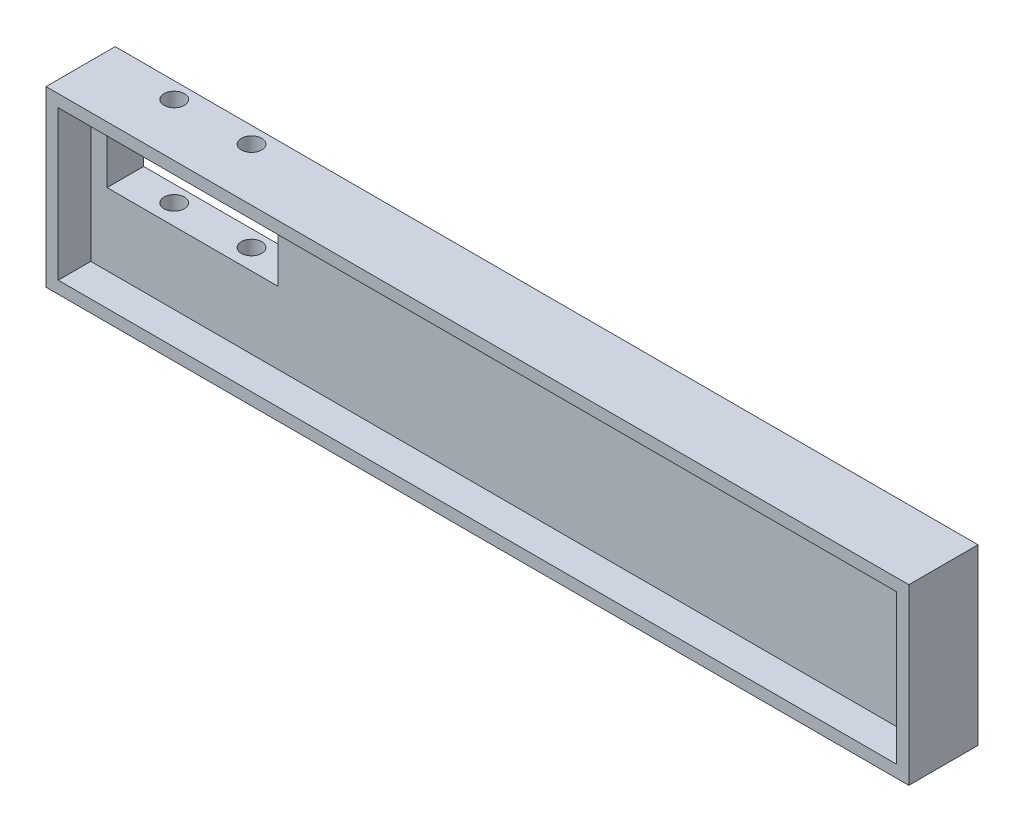
ISO-10303-21;
HEADER;
FILE_DESCRIPTION(('STEP AP214'),'2;1');
FILE_NAME('part.step','',(''),(''),'','','');
FILE_SCHEMA(('AUTOMOTIVE_DESIGN { 1 0 10303 214 1 1 1 1 }'));
ENDSEC;
DATA;
#1=APPLICATION_CONTEXT('core data for automotive mechanical design processes');
#2=APPLICATION_PROTOCOL_DEFINITION('international standard','automotive_design',2000,#1);
#3=PRODUCT_CONTEXT('',#1,'mechanical');
#4=PRODUCT('Part','Part','',(#3));
#5=PRODUCT_RELATED_PRODUCT_CATEGORY('part','',(#4));
#6=PRODUCT_DEFINITION_FORMATION('','',#4);
#7=PRODUCT_DEFINITION_CONTEXT('part definition',#1,'design');
#8=PRODUCT_DEFINITION('design','',#6,#7);
#9=PRODUCT_DEFINITION_SHAPE('','',#8);
#10=(LENGTH_UNIT() NAMED_UNIT(*) SI_UNIT(.MILLI.,.METRE.));
#11=(NAMED_UNIT(*) PLANE_ANGLE_UNIT() SI_UNIT($,.RADIAN.));
#12=(NAMED_UNIT(*) SI_UNIT($,.STERADIAN.) SOLID_ANGLE_UNIT());
#13=UNCERTAINTY_MEASURE_WITH_UNIT(LENGTH_MEASURE(1.E-05),#10,'distance_accuracy_value','');
#14=(GEOMETRIC_REPRESENTATION_CONTEXT(3) GLOBAL_UNCERTAINTY_ASSIGNED_CONTEXT((#13)) GLOBAL_UNIT_ASSIGNED_CONTEXT((#10,
#11,#12)) REPRESENTATION_CONTEXT('',''));
#15=CARTESIAN_POINT('',(0.,0.,0.));
#16=DIRECTION('',(0.,0.,1.));
#17=DIRECTION('',(1.,0.,0.));
#18=AXIS2_PLACEMENT_3D('',#15,#16,#17);
#19=CARTESIAN_POINT('',(-7.,0.,5.));
#20=DIRECTION('',(1.,0.,0.));
#21=DIRECTION('',(0.,1.,0.));
#22=AXIS2_PLACEMENT_3D('',#19,#20,#21);
#23=PLANE('',#22);
#24=DIRECTION('',(0.,0.,-1.));
#25=VECTOR('',#24,1.);
#26=CARTESIAN_POINT('',(-7.,18.3911439114408,5.));
#27=LINE('',#26,#25);
#28=CARTESIAN_POINT('',(-7.,18.3911439114408,5.));
#29=VERTEX_POINT('',#28);
#30=CARTESIAN_POINT('',(-7.,18.3911439114408,-3.5));
#31=VERTEX_POINT('',#30);
#32=EDGE_CURVE('E228',#29,#31,#27,.T.);
#33=ORIENTED_EDGE('',*,*,#32,.T.);
#34=DIRECTION('',(0.,-1.,0.));
#35=VECTOR('',#34,1.);
#36=CARTESIAN_POINT('',(-7.,0.,-3.5));
#37=LINE('',#36,#35);
#38=CARTESIAN_POINT('',(-7.,-2.95885608855919,-3.5));
#39=VERTEX_POINT('',#38);
#40=EDGE_CURVE('E181',#31,#39,#37,.T.);
#41=ORIENTED_EDGE('',*,*,#40,.T.);
#42=DIRECTION('',(0.,0.,-1.));
#43=VECTOR('',#42,1.);
#44=CARTESIAN_POINT('',(-7.,-2.95885608855919,5.));
#45=LINE('',#44,#43);
#46=CARTESIAN_POINT('',(-7.,-2.95885608855919,5.));
#47=VERTEX_POINT('',#46);
#48=EDGE_CURVE('E11',#47,#39,#45,.T.);
#49=ORIENTED_EDGE('',*,*,#48,.F.);
#50=DIRECTION('',(0.,-1.,0.));
#51=VECTOR('',#50,1.);
#52=CARTESIAN_POINT('',(-7.,0.,5.));
#53=LINE('',#52,#51);
#54=EDGE_CURVE('E218',#29,#47,#53,.T.);
#55=ORIENTED_EDGE('',*,*,#54,.F.);
#56=EDGE_LOOP('',(#33,#41,#49,#55));
#57=FACE_BOUND('',#56,.T.);
#58=ADVANCED_FACE('F35',(#57),#23,.F.);
#59=CARTESIAN_POINT('',(0.,-2.95885608855918,5.));
#60=DIRECTION('',(0.,1.,0.));
#61=DIRECTION('',(-1.,0.,0.));
#62=AXIS2_PLACEMENT_3D('',#59,#60,#61);
#63=PLANE('',#62);
#64=CARTESIAN_POINT('',(11.75,-2.95885608855918,-1.5));
#65=DIRECTION('',(0.,1.,0.));
#66=DIRECTION('',(-1.,0.,0.));
#67=AXIS2_PLACEMENT_3D('',#64,#65,#66);
#68=CIRCLE('',#67,1.25);
#69=CARTESIAN_POINT('',(10.5,-2.95885608855918,-1.5));
#70=VERTEX_POINT('',#69);
#71=EDGE_CURVE('E162',#70,#70,#68,.T.);
#72=ORIENTED_EDGE('',*,*,#71,.T.);
#73=EDGE_LOOP('',(#72));
#74=FACE_BOUND('',#73,.T.);
#75=CARTESIAN_POINT('',(2.25,-2.95885608855918,-1.5));
#76=DIRECTION('',(0.,1.,0.));
#77=DIRECTION('',(-1.,0.,0.));
#78=AXIS2_PLACEMENT_3D('',#75,#76,#77);
#79=CIRCLE('',#78,1.25);
#80=CARTESIAN_POINT('',(0.999999999999998,-2.95885608855918,-1.5));
#81=VERTEX_POINT('',#80);
#82=EDGE_CURVE('E171',#81,#81,#79,.T.);
#83=ORIENTED_EDGE('',*,*,#82,.T.);
#84=EDGE_LOOP('',(#83));
#85=FACE_BOUND('',#84,.T.);
#86=ORIENTED_EDGE('',*,*,#48,.T.);
#87=DIRECTION('',(1.,0.,0.));
#88=VECTOR('',#87,1.);
#89=CARTESIAN_POINT('',(0.,-2.95885608855918,-3.5));
#90=LINE('',#89,#88);
#91=CARTESIAN_POINT('',(99.,-2.95885608855919,-3.5));
#92=VERTEX_POINT('',#91);
#93=EDGE_CURVE('E184',#39,#92,#90,.T.);
#94=ORIENTED_EDGE('',*,*,#93,.T.);
#95=DIRECTION('',(0.,0.,-1.));
#96=VECTOR('',#95,1.);
#97=CARTESIAN_POINT('',(99.,-2.95885608855919,5.));
#98=LINE('',#97,#96);
#99=CARTESIAN_POINT('',(99.,-2.95885608855919,5.));
#100=VERTEX_POINT('',#99);
#101=EDGE_CURVE('E44',#100,#92,#98,.T.);
#102=ORIENTED_EDGE('',*,*,#101,.F.);
#103=DIRECTION('',(1.,0.,0.));
#104=VECTOR('',#103,1.);
#105=CARTESIAN_POINT('',(0.,-2.95885608855918,5.));
#106=LINE('',#105,#104);
#107=EDGE_CURVE('E221',#47,#100,#106,.T.);
#108=ORIENTED_EDGE('',*,*,#107,.F.);
#109=EDGE_LOOP('',(#86,#94,#102,#108));
#110=FACE_BOUND('',#109,.T.);
#111=ADVANCED_FACE('F277',(#74,#85,#110),#63,.F.);
#112=CARTESIAN_POINT('',(99.,0.,5.));
#113=DIRECTION('',(1.,0.,0.));
#114=DIRECTION('',(0.,0.,-1.));
#115=AXIS2_PLACEMENT_3D('',#112,#113,#114);
#116=PLANE('',#115);
#117=ORIENTED_EDGE('',*,*,#101,.T.);
#118=DIRECTION('',(0.,-1.,0.));
#119=VECTOR('',#118,1.);
#120=CARTESIAN_POINT('',(99.,0.,-3.5));
#121=LINE('',#120,#119);
#122=CARTESIAN_POINT('',(99.,18.3911439114409,-3.5));
#123=VERTEX_POINT('',#122);
#124=EDGE_CURVE('E187',#123,#92,#121,.T.);
#125=ORIENTED_EDGE('',*,*,#124,.F.);
#126=DIRECTION('',(0.,0.,-1.));
#127=VECTOR('',#126,1.);
#128=CARTESIAN_POINT('',(99.,18.3911439114409,5.));
#129=LINE('',#128,#127);
#130=CARTESIAN_POINT('',(99.,18.3911439114409,5.));
#131=VERTEX_POINT('',#130);
#132=EDGE_CURVE('E230',#131,#123,#129,.T.);
#133=ORIENTED_EDGE('',*,*,#132,.F.);
#134=DIRECTION('',(0.,-1.,0.));
#135=VECTOR('',#134,1.);
#136=CARTESIAN_POINT('',(99.,0.,5.));
#137=LINE('',#136,#135);
#138=EDGE_CURVE('E223',#131,#100,#137,.T.);
#139=ORIENTED_EDGE('',*,*,#138,.T.);
#140=EDGE_LOOP('',(#117,#125,#133,#139));
#141=FACE_BOUND('',#140,.T.);
#142=ADVANCED_FACE('F283',(#141),#116,.T.);
#143=CARTESIAN_POINT('',(0.,16.8911439114407,5.));
#144=DIRECTION('',(0.,-1.,0.));
#145=DIRECTION('',(1.,0.,0.));
#146=AXIS2_PLACEMENT_3D('',#143,#144,#145);
#147=PLANE('',#146);
#148=DIRECTION('',(-1.,0.,0.));
#149=VECTOR('',#148,1.);
#150=CARTESIAN_POINT('',(0.,16.8911439114407,1.));
#151=LINE('',#150,#149);
#152=CARTESIAN_POINT('',(97.5,16.8911439114409,1.));
#153=VERTEX_POINT('',#152);
#154=CARTESIAN_POINT('',(-5.5,16.8911439114408,1.));
#155=VERTEX_POINT('',#154);
#156=EDGE_CURVE('E52',#153,#155,#151,.T.);
#157=ORIENTED_EDGE('',*,*,#156,.F.);
#158=DIRECTION('',(0.,0.,-1.));
#159=VECTOR('',#158,1.);
#160=CARTESIAN_POINT('',(97.5,16.8911439114409,5.));
#161=LINE('',#160,#159);
#162=CARTESIAN_POINT('',(97.5,16.8911439114409,5.));
#163=VERTEX_POINT('',#162);
#164=EDGE_CURVE('E231',#163,#153,#161,.T.);
#165=ORIENTED_EDGE('',*,*,#164,.F.);
#166=DIRECTION('',(-1.,0.,0.));
#167=VECTOR('',#166,1.);
#168=CARTESIAN_POINT('',(0.,16.8911439114407,5.));
#169=LINE('',#168,#167);
#170=CARTESIAN_POINT('',(-5.5,16.8911439114408,5.));
#171=VERTEX_POINT('',#170);
#172=EDGE_CURVE('E205',#163,#171,#169,.T.);
#173=ORIENTED_EDGE('',*,*,#172,.T.);
#174=DIRECTION('',(0.,0.,-1.));
#175=VECTOR('',#174,1.);
#176=CARTESIAN_POINT('',(-5.5,16.8911439114408,5.));
#177=LINE('',#176,#175);
#178=EDGE_CURVE('E137',#171,#155,#177,.T.);
#179=ORIENTED_EDGE('',*,*,#178,.T.);
#180=EDGE_LOOP('',(#157,#165,#173,#179));
#181=FACE_BOUND('',#180,.T.);
#182=ADVANCED_FACE('F37',(#181),#147,.T.);
#183=CARTESIAN_POINT('',(97.5,0.,5.));
#184=DIRECTION('',(1.,0.,0.));
#185=DIRECTION('',(0.,0.,-1.));
#186=AXIS2_PLACEMENT_3D('',#183,#184,#185);
#187=PLANE('',#186);
#188=ORIENTED_EDGE('',*,*,#164,.T.);
#189=DIRECTION('',(0.,-1.,0.));
#190=VECTOR('',#189,1.);
#191=CARTESIAN_POINT('',(97.5,0.,1.));
#192=LINE('',#191,#190);
#193=CARTESIAN_POINT('',(97.5,-1.45885608855919,1.));
#194=VERTEX_POINT('',#193);
#195=EDGE_CURVE('E59',#153,#194,#192,.T.);
#196=ORIENTED_EDGE('',*,*,#195,.T.);
#197=DIRECTION('',(0.,0.,-1.));
#198=VECTOR('',#197,1.);
#199=CARTESIAN_POINT('',(97.5,-1.45885608855919,5.));
#200=LINE('',#199,#198);
#201=CARTESIAN_POINT('',(97.5,-1.45885608855919,5.));
#202=VERTEX_POINT('',#201);
#203=EDGE_CURVE('E136',#202,#194,#200,.T.);
#204=ORIENTED_EDGE('',*,*,#203,.F.);
#205=DIRECTION('',(0.,-1.,0.));
#206=VECTOR('',#205,1.);
#207=CARTESIAN_POINT('',(97.5,0.,5.));
#208=LINE('',#207,#206);
#209=EDGE_CURVE('E213',#163,#202,#208,.T.);
#210=ORIENTED_EDGE('',*,*,#209,.F.);
#211=EDGE_LOOP('',(#188,#196,#204,#210));
#212=FACE_BOUND('',#211,.T.);
#213=ADVANCED_FACE('F292',(#212),#187,.F.);
#214=CARTESIAN_POINT('',(0.,-1.45885608855878,5.));
#215=DIRECTION('',(0.,-1.,0.));
#216=DIRECTION('',(1.,0.,0.));
#217=AXIS2_PLACEMENT_3D('',#214,#215,#216);
#218=PLANE('',#217);
#219=ORIENTED_EDGE('',*,*,#203,.T.);
#220=DIRECTION('',(1.,0.,0.));
#221=VECTOR('',#220,1.);
#222=CARTESIAN_POINT('',(0.,-1.45885608855918,1.));
#223=LINE('',#222,#221);
#224=CARTESIAN_POINT('',(-5.5,-1.45885608855919,1.));
#225=VERTEX_POINT('',#224);
#226=EDGE_CURVE('E140',#225,#194,#223,.T.);
#227=ORIENTED_EDGE('',*,*,#226,.F.);
#228=DIRECTION('',(0.,0.,-1.));
#229=VECTOR('',#228,1.);
#230=CARTESIAN_POINT('',(-5.5,-1.45885608855919,5.));
#231=LINE('',#230,#229);
#232=CARTESIAN_POINT('',(-5.5,-1.45885608855919,5.));
#233=VERTEX_POINT('',#232);
#234=EDGE_CURVE('E127',#233,#225,#231,.T.);
#235=ORIENTED_EDGE('',*,*,#234,.F.);
#236=DIRECTION('',(-1.,0.,0.));
#237=VECTOR('',#236,1.);
#238=CARTESIAN_POINT('',(0.,-1.45885608855878,5.));
#239=LINE('',#238,#237);
#240=EDGE_CURVE('E215',#202,#233,#239,.T.);
#241=ORIENTED_EDGE('',*,*,#240,.F.);
#242=EDGE_LOOP('',(#219,#227,#235,#241));
#243=FACE_BOUND('',#242,.T.);
#244=ADVANCED_FACE('F141',(#243),#218,.F.);
#245=CARTESIAN_POINT('',(-5.5,0.,5.));
#246=DIRECTION('',(1.,0.,0.));
#247=DIRECTION('',(0.,1.,0.));
#248=AXIS2_PLACEMENT_3D('',#245,#246,#247);
#249=PLANE('',#248);
#250=DIRECTION('',(0.,-1.,0.));
#251=VECTOR('',#250,1.);
#252=CARTESIAN_POINT('',(-5.5,0.,1.));
#253=LINE('',#252,#251);
#254=EDGE_CURVE('E131',#155,#225,#253,.T.);
#255=ORIENTED_EDGE('',*,*,#254,.F.);
#256=ORIENTED_EDGE('',*,*,#178,.F.);
#257=DIRECTION('',(0.,-1.,0.));
#258=VECTOR('',#257,1.);
#259=CARTESIAN_POINT('',(-5.5,0.,5.));
#260=LINE('',#259,#258);
#261=EDGE_CURVE('E133',#171,#233,#260,.T.);
#262=ORIENTED_EDGE('',*,*,#261,.T.);
#263=ORIENTED_EDGE('',*,*,#234,.T.);
#264=EDGE_LOOP('',(#255,#256,#262,#263));
#265=FACE_BOUND('',#264,.T.);
#266=ADVANCED_FACE('F129',(#265),#249,.T.);
#267=CARTESIAN_POINT('',(0.,18.3911439114408,5.));
#268=DIRECTION('',(0.,-1.,0.));
#269=DIRECTION('',(1.,0.,0.));
#270=AXIS2_PLACEMENT_3D('',#267,#268,#269);
#271=PLANE('',#270);
#272=CARTESIAN_POINT('',(11.75,18.3911439114408,-1.5));
#273=DIRECTION('',(0.,-1.,0.));
#274=DIRECTION('',(1.,0.,0.));
#275=AXIS2_PLACEMENT_3D('',#272,#273,#274);
#276=CIRCLE('',#275,1.25);
#277=CARTESIAN_POINT('',(13.,18.3911439114408,-1.5));
#278=VERTEX_POINT('',#277);
#279=EDGE_CURVE('E168',#278,#278,#276,.F.);
#280=ORIENTED_EDGE('',*,*,#279,.F.);
#281=EDGE_LOOP('',(#280));
#282=FACE_BOUND('',#281,.T.);
#283=CARTESIAN_POINT('',(2.25,18.3911439114408,-1.5));
#284=DIRECTION('',(0.,-1.,0.));
#285=DIRECTION('',(1.,0.,0.));
#286=AXIS2_PLACEMENT_3D('',#283,#284,#285);
#287=CIRCLE('',#286,1.25);
#288=CARTESIAN_POINT('',(3.5,18.3911439114408,-1.5));
#289=VERTEX_POINT('',#288);
#290=EDGE_CURVE('E178',#289,#289,#287,.F.);
#291=ORIENTED_EDGE('',*,*,#290,.F.);
#292=EDGE_LOOP('',(#291));
#293=FACE_BOUND('',#292,.T.);
#294=ORIENTED_EDGE('',*,*,#132,.T.);
#295=DIRECTION('',(-1.,0.,0.));
#296=VECTOR('',#295,1.);
#297=CARTESIAN_POINT('',(0.,18.3911439114408,-3.5));
#298=LINE('',#297,#296);
#299=EDGE_CURVE('E190',#123,#31,#298,.T.);
#300=ORIENTED_EDGE('',*,*,#299,.T.);
#301=ORIENTED_EDGE('',*,*,#32,.F.);
#302=DIRECTION('',(-1.,0.,0.));
#303=VECTOR('',#302,1.);
#304=CARTESIAN_POINT('',(0.,18.3911439114408,5.));
#305=LINE('',#304,#303);
#306=EDGE_CURVE('E226',#131,#29,#305,.T.);
#307=ORIENTED_EDGE('',*,*,#306,.F.);
#308=EDGE_LOOP('',(#294,#300,#301,#307));
#309=FACE_BOUND('',#308,.T.);
#310=ADVANCED_FACE('F290',(#282,#293,#309),#271,.F.);
#311=CARTESIAN_POINT('',(0.,0.,5.));
#312=DIRECTION('',(0.,0.,1.));
#313=DIRECTION('',(1.,0.,0.));
#314=AXIS2_PLACEMENT_3D('',#311,#312,#313);
#315=PLANE('',#314);
#316=ORIENTED_EDGE('',*,*,#172,.F.);
#317=ORIENTED_EDGE('',*,*,#209,.T.);
#318=ORIENTED_EDGE('',*,*,#240,.T.);
#319=ORIENTED_EDGE('',*,*,#261,.F.);
#320=EDGE_LOOP('',(#316,#317,#318,#319));
#321=FACE_BOUND('',#320,.T.);
#322=ORIENTED_EDGE('',*,*,#54,.T.);
#323=ORIENTED_EDGE('',*,*,#107,.T.);
#324=ORIENTED_EDGE('',*,*,#138,.F.);
#325=ORIENTED_EDGE('',*,*,#306,.T.);
#326=EDGE_LOOP('',(#322,#323,#324,#325));
#327=FACE_BOUND('',#326,.T.);
#328=ADVANCED_FACE('F300',(#321,#327),#315,.T.);
#329=CARTESIAN_POINT('',(17.5,0.,-3.5));
#330=DIRECTION('',(1.,0.,0.));
#331=DIRECTION('',(0.,0.,-1.));
#332=AXIS2_PLACEMENT_3D('',#329,#330,#331);
#333=PLANE('',#332);
#334=DIRECTION('',(0.,0.,1.));
#335=VECTOR('',#334,1.);
#336=CARTESIAN_POINT('',(17.5,7.39114391144082,-3.5));
#337=LINE('',#336,#335);
#338=CARTESIAN_POINT('',(17.5,7.39114391144082,-3.5));
#339=VERTEX_POINT('',#338);
#340=CARTESIAN_POINT('',(17.5,7.39114391144082,1.));
#341=VERTEX_POINT('',#340);
#342=EDGE_CURVE('E202',#339,#341,#337,.T.);
#343=ORIENTED_EDGE('',*,*,#342,.T.);
#344=DIRECTION('',(0.,1.,0.));
#345=VECTOR('',#344,1.);
#346=CARTESIAN_POINT('',(17.5,0.,1.));
#347=LINE('',#346,#345);
#348=CARTESIAN_POINT('',(17.5,14.8911439114408,1.));
#349=VERTEX_POINT('',#348);
#350=EDGE_CURVE('E143',#341,#349,#347,.T.);
#351=ORIENTED_EDGE('',*,*,#350,.T.);
#352=DIRECTION('',(0.,0.,1.));
#353=VECTOR('',#352,1.);
#354=CARTESIAN_POINT('',(17.5,14.8911439114408,-3.5));
#355=LINE('',#354,#353);
#356=CARTESIAN_POINT('',(17.5,14.8911439114408,-3.5));
#357=VERTEX_POINT('',#356);
#358=EDGE_CURVE('E203',#357,#349,#355,.T.);
#359=ORIENTED_EDGE('',*,*,#358,.F.);
#360=DIRECTION('',(0.,1.,0.));
#361=VECTOR('',#360,1.);
#362=CARTESIAN_POINT('',(17.5,0.,-3.5));
#363=LINE('',#362,#361);
#364=EDGE_CURVE('E193',#339,#357,#363,.T.);
#365=ORIENTED_EDGE('',*,*,#364,.F.);
#366=EDGE_LOOP('',(#343,#351,#359,#365));
#367=FACE_BOUND('',#366,.T.);
#368=ADVANCED_FACE('F262',(#367),#333,.F.);
#369=CARTESIAN_POINT('',(0.,14.8911439114408,-3.5));
#370=DIRECTION('',(0.,-1.,0.));
#371=DIRECTION('',(0.,0.,-1.));
#372=AXIS2_PLACEMENT_3D('',#369,#370,#371);
#373=PLANE('',#372);
#374=CARTESIAN_POINT('',(11.75,14.8911439114408,-1.5));
#375=DIRECTION('',(0.,-1.,0.));
#376=DIRECTION('',(0.,0.,-1.));
#377=AXIS2_PLACEMENT_3D('',#374,#375,#376);
#378=CIRCLE('',#377,1.25);
#379=CARTESIAN_POINT('',(11.75,14.8911439114408,-2.75));
#380=VERTEX_POINT('',#379);
#381=EDGE_CURVE('E165',#380,#380,#378,.F.);
#382=ORIENTED_EDGE('',*,*,#381,.T.);
#383=EDGE_LOOP('',(#382));
#384=FACE_BOUND('',#383,.T.);
#385=CARTESIAN_POINT('',(2.25,14.8911439114408,-1.5));
#386=DIRECTION('',(0.,-1.,0.));
#387=DIRECTION('',(0.,0.,-1.));
#388=AXIS2_PLACEMENT_3D('',#385,#386,#387);
#389=CIRCLE('',#388,1.25);
#390=CARTESIAN_POINT('',(2.25,14.8911439114408,-2.75));
#391=VERTEX_POINT('',#390);
#392=EDGE_CURVE('E175',#391,#391,#389,.F.);
#393=ORIENTED_EDGE('',*,*,#392,.T.);
#394=EDGE_LOOP('',(#393));
#395=FACE_BOUND('',#394,.T.);
#396=ORIENTED_EDGE('',*,*,#358,.T.);
#397=DIRECTION('',(1.,0.,0.));
#398=VECTOR('',#397,1.);
#399=CARTESIAN_POINT('',(0.,14.8911439114408,1.));
#400=LINE('',#399,#398);
#401=CARTESIAN_POINT('',(-3.5,14.8911439114408,1.));
#402=VERTEX_POINT('',#401);
#403=EDGE_CURVE('E159',#402,#349,#400,.T.);
#404=ORIENTED_EDGE('',*,*,#403,.F.);
#405=DIRECTION('',(0.,0.,1.));
#406=VECTOR('',#405,1.);
#407=CARTESIAN_POINT('',(-3.5,14.8911439114408,-3.5));
#408=LINE('',#407,#406);
#409=CARTESIAN_POINT('',(-3.5,14.8911439114408,-3.5));
#410=VERTEX_POINT('',#409);
#411=EDGE_CURVE('E206',#410,#402,#408,.T.);
#412=ORIENTED_EDGE('',*,*,#411,.F.);
#413=DIRECTION('',(1.,0.,0.));
#414=VECTOR('',#413,1.);
#415=CARTESIAN_POINT('',(0.,14.8911439114408,-3.5));
#416=LINE('',#415,#414);
#417=EDGE_CURVE('E199',#410,#357,#416,.T.);
#418=ORIENTED_EDGE('',*,*,#417,.T.);
#419=EDGE_LOOP('',(#396,#404,#412,#418));
#420=FACE_BOUND('',#419,.T.);
#421=ADVANCED_FACE('F259',(#384,#395,#420),#373,.T.);
#422=CARTESIAN_POINT('',(-3.5,0.,-3.5));
#423=DIRECTION('',(-1.,0.,0.));
#424=DIRECTION('',(0.,-1.,0.));
#425=AXIS2_PLACEMENT_3D('',#422,#423,#424);
#426=PLANE('',#425);
#427=ORIENTED_EDGE('',*,*,#411,.T.);
#428=DIRECTION('',(0.,-1.,0.));
#429=VECTOR('',#428,1.);
#430=CARTESIAN_POINT('',(-3.5,0.,1.));
#431=LINE('',#430,#429);
#432=CARTESIAN_POINT('',(-3.5,7.39114391144082,1.));
#433=VERTEX_POINT('',#432);
#434=EDGE_CURVE('E156',#402,#433,#431,.T.);
#435=ORIENTED_EDGE('',*,*,#434,.T.);
#436=DIRECTION('',(0.,0.,1.));
#437=VECTOR('',#436,1.);
#438=CARTESIAN_POINT('',(-3.5,7.39114391144082,-3.5));
#439=LINE('',#438,#437);
#440=CARTESIAN_POINT('',(-3.5,7.39114391144082,-3.5));
#441=VERTEX_POINT('',#440);
#442=EDGE_CURVE('E208',#441,#433,#439,.T.);
#443=ORIENTED_EDGE('',*,*,#442,.F.);
#444=DIRECTION('',(0.,-1.,0.));
#445=VECTOR('',#444,1.);
#446=CARTESIAN_POINT('',(-3.5,0.,-3.5));
#447=LINE('',#446,#445);
#448=EDGE_CURVE('E197',#410,#441,#447,.T.);
#449=ORIENTED_EDGE('',*,*,#448,.F.);
#450=EDGE_LOOP('',(#427,#435,#443,#449));
#451=FACE_BOUND('',#450,.T.);
#452=ADVANCED_FACE('F245',(#451),#426,.F.);
#453=CARTESIAN_POINT('',(0.,7.39114391144082,-3.5));
#454=DIRECTION('',(0.,-1.,0.));
#455=DIRECTION('',(0.,0.,-1.));
#456=AXIS2_PLACEMENT_3D('',#453,#454,#455);
#457=PLANE('',#456);
#458=CARTESIAN_POINT('',(11.75,7.39114391144081,-1.5));
#459=DIRECTION('',(0.,-1.,0.));
#460=DIRECTION('',(0.,0.,-1.));
#461=AXIS2_PLACEMENT_3D('',#458,#459,#460);
#462=CIRCLE('',#461,1.25);
#463=CARTESIAN_POINT('',(11.75,7.39114391144081,-2.75));
#464=VERTEX_POINT('',#463);
#465=EDGE_CURVE('E39',#464,#464,#462,.F.);
#466=ORIENTED_EDGE('',*,*,#465,.F.);
#467=EDGE_LOOP('',(#466));
#468=FACE_BOUND('',#467,.T.);
#469=CARTESIAN_POINT('',(2.25,7.39114391144082,-1.5));
#470=DIRECTION('',(0.,-1.,0.));
#471=DIRECTION('',(0.,0.,-1.));
#472=AXIS2_PLACEMENT_3D('',#469,#470,#471);
#473=CIRCLE('',#472,1.25);
#474=CARTESIAN_POINT('',(2.25,7.39114391144082,-2.75));
#475=VERTEX_POINT('',#474);
#476=EDGE_CURVE('E174',#475,#475,#473,.F.);
#477=ORIENTED_EDGE('',*,*,#476,.F.);
#478=EDGE_LOOP('',(#477));
#479=FACE_BOUND('',#478,.T.);
#480=ORIENTED_EDGE('',*,*,#442,.T.);
#481=DIRECTION('',(1.,0.,0.));
#482=VECTOR('',#481,1.);
#483=CARTESIAN_POINT('',(0.,7.39114391144082,1.));
#484=LINE('',#483,#482);
#485=EDGE_CURVE('E153',#433,#341,#484,.T.);
#486=ORIENTED_EDGE('',*,*,#485,.T.);
#487=ORIENTED_EDGE('',*,*,#342,.F.);
#488=DIRECTION('',(1.,0.,0.));
#489=VECTOR('',#488,1.);
#490=CARTESIAN_POINT('',(0.,7.39114391144082,-3.5));
#491=LINE('',#490,#489);
#492=EDGE_CURVE('E195',#441,#339,#491,.T.);
#493=ORIENTED_EDGE('',*,*,#492,.F.);
#494=EDGE_LOOP('',(#480,#486,#487,#493));
#495=FACE_BOUND('',#494,.T.);
#496=ADVANCED_FACE('F241',(#468,#479,#495),#457,.F.);
#497=CARTESIAN_POINT('',(0.,0.,-3.5));
#498=DIRECTION('',(0.,0.,1.));
#499=DIRECTION('',(1.,0.,0.));
#500=AXIS2_PLACEMENT_3D('',#497,#498,#499);
#501=PLANE('',#500);
#502=ORIENTED_EDGE('',*,*,#40,.F.);
#503=ORIENTED_EDGE('',*,*,#299,.F.);
#504=ORIENTED_EDGE('',*,*,#124,.T.);
#505=ORIENTED_EDGE('',*,*,#93,.F.);
#506=EDGE_LOOP('',(#502,#503,#504,#505));
#507=FACE_BOUND('',#506,.T.);
#508=ORIENTED_EDGE('',*,*,#364,.T.);
#509=ORIENTED_EDGE('',*,*,#417,.F.);
#510=ORIENTED_EDGE('',*,*,#448,.T.);
#511=ORIENTED_EDGE('',*,*,#492,.T.);
#512=EDGE_LOOP('',(#508,#509,#510,#511));
#513=FACE_BOUND('',#512,.T.);
#514=ADVANCED_FACE('F244',(#507,#513),#501,.F.);
#515=CARTESIAN_POINT('',(2.25,27.0411439114408,-1.5));
#516=DIRECTION('',(0.,-1.,0.));
#517=DIRECTION('',(0.,0.,-1.));
#518=AXIS2_PLACEMENT_3D('',#515,#516,#517);
#519=CYLINDRICAL_SURFACE('',#518,1.25);
#520=ORIENTED_EDGE('',*,*,#82,.F.);
#521=EDGE_LOOP('',(#520));
#522=FACE_BOUND('',#521,.T.);
#523=ORIENTED_EDGE('',*,*,#476,.T.);
#524=EDGE_LOOP('',(#523));
#525=FACE_BOUND('',#524,.T.);
#526=ADVANCED_FACE('F239',(#522,#525),#519,.F.);
#527=ORIENTED_EDGE('',*,*,#392,.F.);
#528=EDGE_LOOP('',(#527));
#529=FACE_BOUND('',#528,.T.);
#530=ORIENTED_EDGE('',*,*,#290,.T.);
#531=EDGE_LOOP('',(#530));
#532=FACE_BOUND('',#531,.T.);
#533=ADVANCED_FACE('F271',(#529,#532),#519,.F.);
#534=CARTESIAN_POINT('',(11.75,27.0411439114408,-1.5));
#535=DIRECTION('',(0.,-1.,0.));
#536=DIRECTION('',(0.,0.,-1.));
#537=AXIS2_PLACEMENT_3D('',#534,#535,#536);
#538=CYLINDRICAL_SURFACE('',#537,1.25);
#539=ORIENTED_EDGE('',*,*,#71,.F.);
#540=EDGE_LOOP('',(#539));
#541=FACE_BOUND('',#540,.T.);
#542=ORIENTED_EDGE('',*,*,#465,.T.);
#543=EDGE_LOOP('',(#542));
#544=FACE_BOUND('',#543,.T.);
#545=ADVANCED_FACE('F407',(#541,#544),#538,.F.);
#546=ORIENTED_EDGE('',*,*,#381,.F.);
#547=EDGE_LOOP('',(#546));
#548=FACE_BOUND('',#547,.T.);
#549=ORIENTED_EDGE('',*,*,#279,.T.);
#550=EDGE_LOOP('',(#549));
#551=FACE_BOUND('',#550,.T.);
#552=ADVANCED_FACE('F340',(#548,#551),#538,.F.);
#553=CARTESIAN_POINT('',(0.,0.,1.));
#554=DIRECTION('',(0.,0.,1.));
#555=DIRECTION('',(1.,0.,0.));
#556=AXIS2_PLACEMENT_3D('',#553,#554,#555);
#557=PLANE('',#556);
#558=ORIENTED_EDGE('',*,*,#195,.F.);
#559=ORIENTED_EDGE('',*,*,#156,.T.);
#560=ORIENTED_EDGE('',*,*,#254,.T.);
#561=ORIENTED_EDGE('',*,*,#226,.T.);
#562=EDGE_LOOP('',(#558,#559,#560,#561));
#563=FACE_BOUND('',#562,.T.);
#564=ORIENTED_EDGE('',*,*,#350,.F.);
#565=ORIENTED_EDGE('',*,*,#485,.F.);
#566=ORIENTED_EDGE('',*,*,#434,.F.);
#567=ORIENTED_EDGE('',*,*,#403,.T.);
#568=EDGE_LOOP('',(#564,#565,#566,#567));
#569=FACE_BOUND('',#568,.T.);
#570=ADVANCED_FACE('F145',(#563,#569),#557,.T.);
#571=CLOSED_SHELL('',(#58,#111,#142,#182,#213,#244,#266,#310,#328,#368,#421,#452,#496,#514,#526,
#533,#545,#552,#570));
#572=MANIFOLD_SOLID_BREP('B2',#571);
#573=ADVANCED_BREP_SHAPE_REPRESENTATION('',(#18,#572),#14);
#574=SHAPE_DEFINITION_REPRESENTATION(#9,#573);
ENDSEC;
END-ISO-10303-21;
